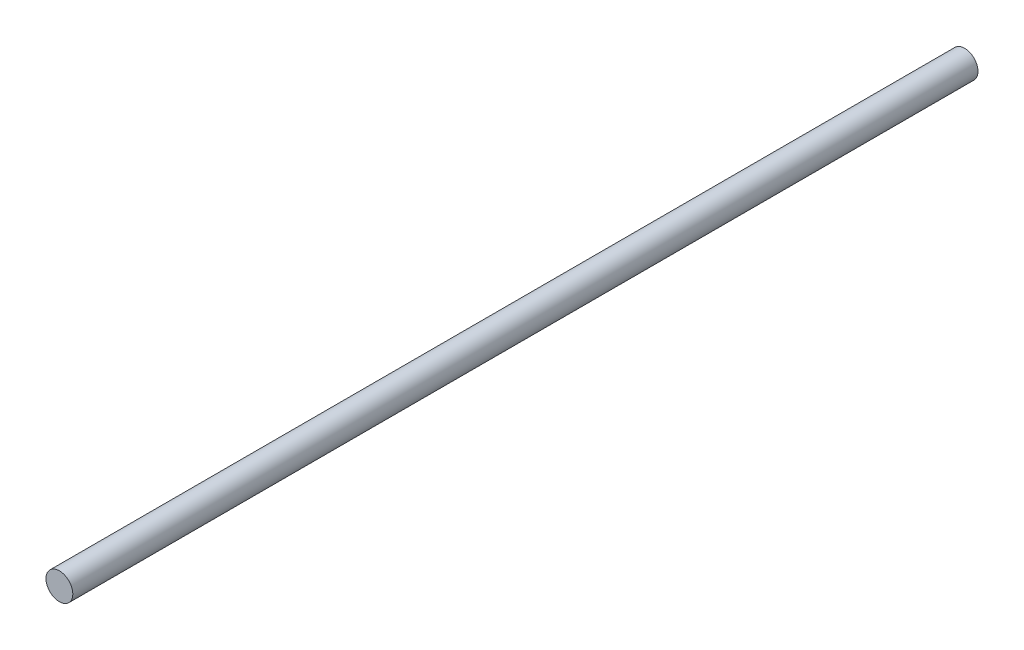
ISO-10303-21;
HEADER;
FILE_DESCRIPTION(('STEP AP214'),'2;1');
FILE_NAME('part.step','',(''),(''),'','','');
FILE_SCHEMA(('AUTOMOTIVE_DESIGN { 1 0 10303 214 1 1 1 1 }'));
ENDSEC;
DATA;
#1=APPLICATION_CONTEXT('core data for automotive mechanical design processes');
#2=APPLICATION_PROTOCOL_DEFINITION('international standard','automotive_design',2000,#1);
#3=PRODUCT_CONTEXT('',#1,'mechanical');
#4=PRODUCT('Part','Part','',(#3));
#5=PRODUCT_RELATED_PRODUCT_CATEGORY('part','',(#4));
#6=PRODUCT_DEFINITION_FORMATION('','',#4);
#7=PRODUCT_DEFINITION_CONTEXT('part definition',#1,'design');
#8=PRODUCT_DEFINITION('design','',#6,#7);
#9=PRODUCT_DEFINITION_SHAPE('','',#8);
#10=(LENGTH_UNIT() NAMED_UNIT(*) SI_UNIT(.MILLI.,.METRE.));
#11=(NAMED_UNIT(*) PLANE_ANGLE_UNIT() SI_UNIT($,.RADIAN.));
#12=(NAMED_UNIT(*) SI_UNIT($,.STERADIAN.) SOLID_ANGLE_UNIT());
#13=UNCERTAINTY_MEASURE_WITH_UNIT(LENGTH_MEASURE(1.E-05),#10,'distance_accuracy_value','');
#14=(GEOMETRIC_REPRESENTATION_CONTEXT(3) GLOBAL_UNCERTAINTY_ASSIGNED_CONTEXT((#13)) GLOBAL_UNIT_ASSIGNED_CONTEXT((#10,
#11,#12)) REPRESENTATION_CONTEXT('',''));
#15=CARTESIAN_POINT('',(0.,0.,0.));
#16=DIRECTION('',(0.,0.,1.));
#17=DIRECTION('',(1.,0.,0.));
#18=AXIS2_PLACEMENT_3D('',#15,#16,#17);
#19=CARTESIAN_POINT('',(0.,0.,270.));
#20=DIRECTION('',(0.,0.,-1.));
#21=DIRECTION('',(-1.,0.,0.));
#22=AXIS2_PLACEMENT_3D('',#19,#20,#21);
#23=CYLINDRICAL_SURFACE('',#22,4.);
#24=CARTESIAN_POINT('',(0.,0.,270.));
#25=DIRECTION('',(0.,0.,1.));
#26=DIRECTION('',(1.,0.,0.));
#27=AXIS2_PLACEMENT_3D('',#24,#25,#26);
#28=CIRCLE('',#27,4.);
#29=CARTESIAN_POINT('',(4.,0.,270.));
#30=VERTEX_POINT('',#29);
#31=EDGE_CURVE('E10',#30,#30,#28,.T.);
#32=ORIENTED_EDGE('',*,*,#31,.F.);
#33=EDGE_LOOP('',(#32));
#34=FACE_BOUND('',#33,.T.);
#35=CARTESIAN_POINT('',(0.,0.,0.));
#36=DIRECTION('',(0.,0.,1.));
#37=DIRECTION('',(1.,0.,0.));
#38=AXIS2_PLACEMENT_3D('',#35,#36,#37);
#39=CIRCLE('',#38,4.);
#40=CARTESIAN_POINT('',(4.,0.,0.));
#41=VERTEX_POINT('',#40);
#42=EDGE_CURVE('E31',#41,#41,#39,.T.);
#43=ORIENTED_EDGE('',*,*,#42,.T.);
#44=EDGE_LOOP('',(#43));
#45=FACE_BOUND('',#44,.T.);
#46=ADVANCED_FACE('F28',(#34,#45),#23,.T.);
#47=CARTESIAN_POINT('',(0.,0.,270.));
#48=DIRECTION('',(0.,0.,1.));
#49=DIRECTION('',(1.,0.,0.));
#50=AXIS2_PLACEMENT_3D('',#47,#48,#49);
#51=PLANE('',#50);
#52=ORIENTED_EDGE('',*,*,#31,.T.);
#53=EDGE_LOOP('',(#52));
#54=FACE_BOUND('',#53,.T.);
#55=ADVANCED_FACE('F43',(#54),#51,.T.);
#56=CARTESIAN_POINT('',(0.,0.,0.));
#57=DIRECTION('',(0.,0.,1.));
#58=DIRECTION('',(1.,0.,0.));
#59=AXIS2_PLACEMENT_3D('',#56,#57,#58);
#60=PLANE('',#59);
#61=ORIENTED_EDGE('',*,*,#42,.F.);
#62=EDGE_LOOP('',(#61));
#63=FACE_BOUND('',#62,.T.);
#64=ADVANCED_FACE('F41',(#63),#60,.F.);
#65=CLOSED_SHELL('',(#46,#55,#64));
#66=MANIFOLD_SOLID_BREP('B2',#65);
#67=ADVANCED_BREP_SHAPE_REPRESENTATION('',(#18,#66),#14);
#68=SHAPE_DEFINITION_REPRESENTATION(#9,#67);
ENDSEC;
END-ISO-10303-21;
